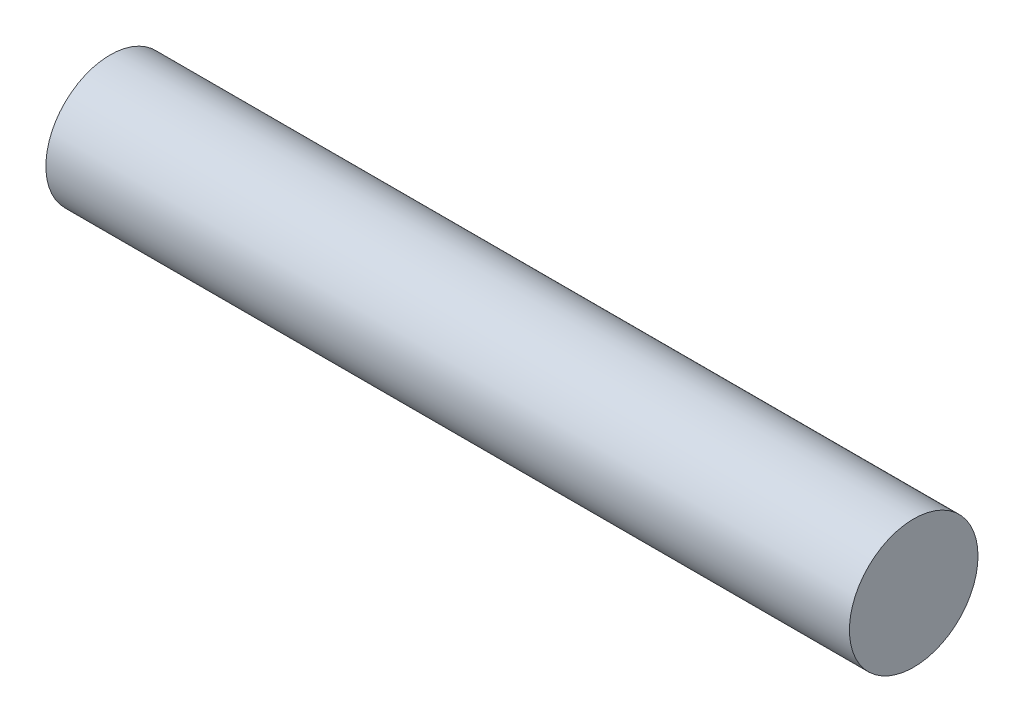
ISO-10303-21;
HEADER;
FILE_DESCRIPTION(('STEP AP214'),'2;1');
FILE_NAME('part.step','',(''),(''),'','','');
FILE_SCHEMA(('AUTOMOTIVE_DESIGN { 1 0 10303 214 1 1 1 1 }'));
ENDSEC;
DATA;
#1=APPLICATION_CONTEXT('core data for automotive mechanical design processes');
#2=APPLICATION_PROTOCOL_DEFINITION('international standard','automotive_design',2000,#1);
#3=PRODUCT_CONTEXT('',#1,'mechanical');
#4=PRODUCT('Part','Part','',(#3));
#5=PRODUCT_RELATED_PRODUCT_CATEGORY('part','',(#4));
#6=PRODUCT_DEFINITION_FORMATION('','',#4);
#7=PRODUCT_DEFINITION_CONTEXT('part definition',#1,'design');
#8=PRODUCT_DEFINITION('design','',#6,#7);
#9=PRODUCT_DEFINITION_SHAPE('','',#8);
#10=(LENGTH_UNIT() NAMED_UNIT(*) SI_UNIT(.MILLI.,.METRE.));
#11=(NAMED_UNIT(*) PLANE_ANGLE_UNIT() SI_UNIT($,.RADIAN.));
#12=(NAMED_UNIT(*) SI_UNIT($,.STERADIAN.) SOLID_ANGLE_UNIT());
#13=UNCERTAINTY_MEASURE_WITH_UNIT(LENGTH_MEASURE(1.E-05),#10,'distance_accuracy_value','');
#14=(GEOMETRIC_REPRESENTATION_CONTEXT(3) GLOBAL_UNCERTAINTY_ASSIGNED_CONTEXT((#13)) GLOBAL_UNIT_ASSIGNED_CONTEXT((#10,
#11,#12)) REPRESENTATION_CONTEXT('',''));
#15=CARTESIAN_POINT('',(0.,0.,0.));
#16=DIRECTION('',(0.,0.,1.));
#17=DIRECTION('',(1.,0.,0.));
#18=AXIS2_PLACEMENT_3D('',#15,#16,#17);
#19=CARTESIAN_POINT('',(100.,0.,0.));
#20=DIRECTION('',(-1.,0.,0.));
#21=DIRECTION('',(0.,0.,1.));
#22=AXIS2_PLACEMENT_3D('',#19,#20,#21);
#23=CYLINDRICAL_SURFACE('',#22,8.);
#24=CARTESIAN_POINT('',(100.,0.,0.));
#25=DIRECTION('',(1.,0.,0.));
#26=DIRECTION('',(0.,0.,-1.));
#27=AXIS2_PLACEMENT_3D('',#24,#25,#26);
#28=CIRCLE('',#27,8.);
#29=CARTESIAN_POINT('',(100.,0.,-8.));
#30=VERTEX_POINT('',#29);
#31=EDGE_CURVE('E10',#30,#30,#28,.T.);
#32=ORIENTED_EDGE('',*,*,#31,.F.);
#33=EDGE_LOOP('',(#32));
#34=FACE_BOUND('',#33,.T.);
#35=CARTESIAN_POINT('',(0.,0.,0.));
#36=DIRECTION('',(1.,0.,0.));
#37=DIRECTION('',(0.,0.,-1.));
#38=AXIS2_PLACEMENT_3D('',#35,#36,#37);
#39=CIRCLE('',#38,8.);
#40=CARTESIAN_POINT('',(0.,0.,-8.));
#41=VERTEX_POINT('',#40);
#42=EDGE_CURVE('E40',#41,#41,#39,.T.);
#43=ORIENTED_EDGE('',*,*,#42,.T.);
#44=EDGE_LOOP('',(#43));
#45=FACE_BOUND('',#44,.T.);
#46=ADVANCED_FACE('F37',(#34,#45),#23,.T.);
#47=CARTESIAN_POINT('',(100.,0.,0.));
#48=DIRECTION('',(1.,0.,0.));
#49=DIRECTION('',(0.,0.,-1.));
#50=AXIS2_PLACEMENT_3D('',#47,#48,#49);
#51=PLANE('',#50);
#52=ORIENTED_EDGE('',*,*,#31,.T.);
#53=EDGE_LOOP('',(#52));
#54=FACE_BOUND('',#53,.T.);
#55=ADVANCED_FACE('F54',(#54),#51,.T.);
#56=CARTESIAN_POINT('',(0.,0.,0.));
#57=DIRECTION('',(1.,0.,0.));
#58=DIRECTION('',(0.,0.,-1.));
#59=AXIS2_PLACEMENT_3D('',#56,#57,#58);
#60=PLANE('',#59);
#61=ORIENTED_EDGE('',*,*,#42,.F.);
#62=EDGE_LOOP('',(#61));
#63=FACE_BOUND('',#62,.T.);
#64=ADVANCED_FACE('F52',(#63),#60,.F.);
#65=CLOSED_SHELL('',(#46,#55,#64));
#66=MANIFOLD_SOLID_BREP('B2',#65);
#67=ADVANCED_BREP_SHAPE_REPRESENTATION('',(#18,#66),#14);
#68=SHAPE_DEFINITION_REPRESENTATION(#9,#67);
ENDSEC;
END-ISO-10303-21;
